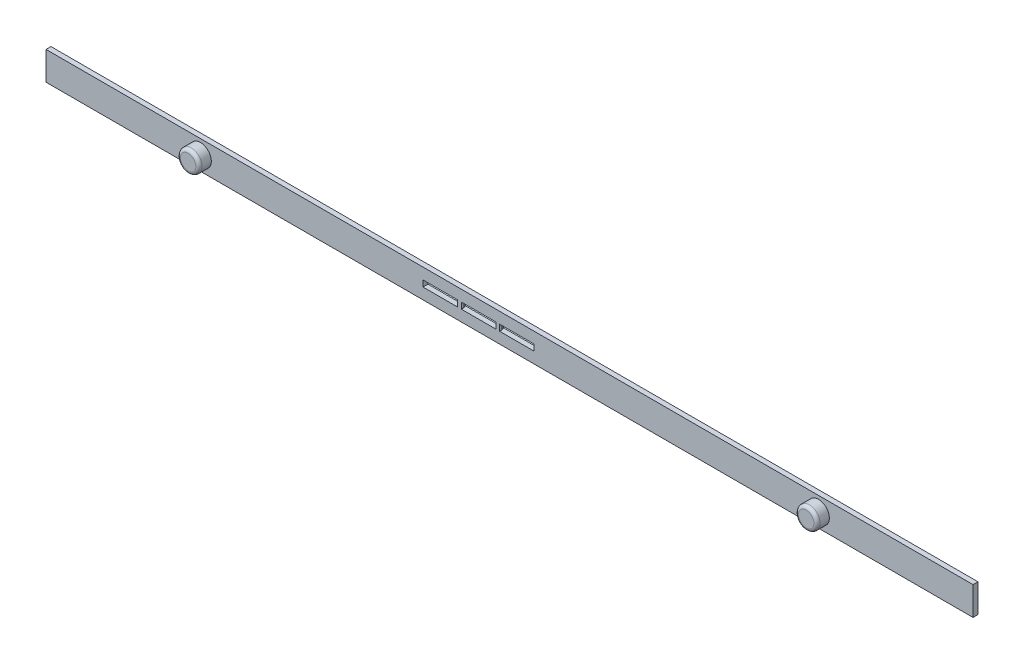
ISO-10303-21;
HEADER;
FILE_DESCRIPTION(('STEP AP214'),'2;1');
FILE_NAME('part.step','',(''),(''),'','','');
FILE_SCHEMA(('AUTOMOTIVE_DESIGN { 1 0 10303 214 1 1 1 1 }'));
ENDSEC;
DATA;
#1=APPLICATION_CONTEXT('core data for automotive mechanical design processes');
#2=APPLICATION_PROTOCOL_DEFINITION('international standard','automotive_design',2000,#1);
#3=PRODUCT_CONTEXT('',#1,'mechanical');
#4=PRODUCT('Part','Part','',(#3));
#5=PRODUCT_RELATED_PRODUCT_CATEGORY('part','',(#4));
#6=PRODUCT_DEFINITION_FORMATION('','',#4);
#7=PRODUCT_DEFINITION_CONTEXT('part definition',#1,'design');
#8=PRODUCT_DEFINITION('design','',#6,#7);
#9=PRODUCT_DEFINITION_SHAPE('','',#8);
#10=(LENGTH_UNIT() NAMED_UNIT(*) SI_UNIT(.MILLI.,.METRE.));
#11=(NAMED_UNIT(*) PLANE_ANGLE_UNIT() SI_UNIT($,.RADIAN.));
#12=(NAMED_UNIT(*) SI_UNIT($,.STERADIAN.) SOLID_ANGLE_UNIT());
#13=UNCERTAINTY_MEASURE_WITH_UNIT(LENGTH_MEASURE(1.E-05),#10,'distance_accuracy_value','');
#14=(GEOMETRIC_REPRESENTATION_CONTEXT(3) GLOBAL_UNCERTAINTY_ASSIGNED_CONTEXT((#13)) GLOBAL_UNIT_ASSIGNED_CONTEXT((#10,
#11,#12)) REPRESENTATION_CONTEXT('',''));
#15=CARTESIAN_POINT('',(0.,0.,0.));
#16=DIRECTION('',(0.,0.,1.));
#17=DIRECTION('',(1.,0.,0.));
#18=AXIS2_PLACEMENT_3D('',#15,#16,#17);
#19=CARTESIAN_POINT('',(4.,-0.499999999999995,0.8));
#20=DIRECTION('',(0.,1.,0.));
#21=DIRECTION('',(-1.,0.,0.));
#22=AXIS2_PLACEMENT_3D('',#19,#20,#21);
#23=PLANE('',#22);
#24=DIRECTION('',(0.,0.,-1.));
#25=VECTOR('',#24,1.);
#26=CARTESIAN_POINT('',(-8.4,-0.499999999999997,0.8));
#27=LINE('',#26,#25);
#28=CARTESIAN_POINT('',(-8.4,-0.499999999999997,0.8));
#29=VERTEX_POINT('',#28);
#30=CARTESIAN_POINT('',(-8.4,-0.499999999999997,0.400000000000012));
#31=VERTEX_POINT('',#30);
#32=EDGE_CURVE('E176',#29,#31,#27,.T.);
#33=ORIENTED_EDGE('',*,*,#32,.T.);
#34=DIRECTION('',(0.342020143325663,0.,-0.939692620785911));
#35=VECTOR('',#34,1.);
#36=CARTESIAN_POINT('',(-8.25441190629352,-0.499999999999996,0.));
#37=LINE('',#36,#35);
#38=CARTESIAN_POINT('',(-8.25441190629352,-0.499999999999996,0.));
#39=VERTEX_POINT('',#38);
#40=EDGE_CURVE('E289',#31,#39,#37,.T.);
#41=ORIENTED_EDGE('',*,*,#40,.T.);
#42=DIRECTION('',(1.,0.,0.));
#43=VECTOR('',#42,1.);
#44=CARTESIAN_POINT('',(4.,-0.499999999999995,0.));
#45=LINE('',#44,#43);
#46=CARTESIAN_POINT('',(-14.,-0.499999999999997,0.));
#47=VERTEX_POINT('',#46);
#48=EDGE_CURVE('E315',#47,#39,#45,.T.);
#49=ORIENTED_EDGE('',*,*,#48,.F.);
#50=DIRECTION('',(0.,0.,-1.));
#51=VECTOR('',#50,1.);
#52=CARTESIAN_POINT('',(-14.,-0.499999999999997,0.8));
#53=LINE('',#52,#51);
#54=CARTESIAN_POINT('',(-14.,-0.499999999999997,0.8));
#55=VERTEX_POINT('',#54);
#56=EDGE_CURVE('E219',#55,#47,#53,.T.);
#57=ORIENTED_EDGE('',*,*,#56,.F.);
#58=DIRECTION('',(1.,0.,0.));
#59=VECTOR('',#58,1.);
#60=CARTESIAN_POINT('',(4.,-0.499999999999995,0.8));
#61=LINE('',#60,#59);
#62=EDGE_CURVE('E202',#55,#29,#61,.T.);
#63=ORIENTED_EDGE('',*,*,#62,.T.);
#64=EDGE_LOOP('',(#33,#41,#49,#57,#63));
#65=FACE_BOUND('',#64,.T.);
#66=ADVANCED_FACE('F33',(#65),#23,.T.);
#67=CARTESIAN_POINT('',(4.,0.500000000000005,0.8));
#68=DIRECTION('',(0.,-1.,0.));
#69=DIRECTION('',(1.,0.,0.));
#70=AXIS2_PLACEMENT_3D('',#67,#68,#69);
#71=PLANE('',#70);
#72=DIRECTION('',(0.,0.,-1.));
#73=VECTOR('',#72,1.);
#74=CARTESIAN_POINT('',(-8.4,0.499999999999994,0.8));
#75=LINE('',#74,#73);
#76=CARTESIAN_POINT('',(-8.4,0.499999999999994,0.8));
#77=VERTEX_POINT('',#76);
#78=CARTESIAN_POINT('',(-8.4,0.499999999999994,0.400000000000012));
#79=VERTEX_POINT('',#78);
#80=EDGE_CURVE('E173',#77,#79,#75,.T.);
#81=ORIENTED_EDGE('',*,*,#80,.F.);
#82=DIRECTION('',(-1.,0.,0.));
#83=VECTOR('',#82,1.);
#84=CARTESIAN_POINT('',(4.,0.500000000000005,0.8));
#85=LINE('',#84,#83);
#86=CARTESIAN_POINT('',(-14.,0.500000000000003,0.8));
#87=VERTEX_POINT('',#86);
#88=EDGE_CURVE('E186',#77,#87,#85,.T.);
#89=ORIENTED_EDGE('',*,*,#88,.T.);
#90=DIRECTION('',(0.,0.,-1.));
#91=VECTOR('',#90,1.);
#92=CARTESIAN_POINT('',(-14.,0.500000000000003,0.8));
#93=LINE('',#92,#91);
#94=CARTESIAN_POINT('',(-14.,0.500000000000003,0.));
#95=VERTEX_POINT('',#94);
#96=EDGE_CURVE('E206',#87,#95,#93,.T.);
#97=ORIENTED_EDGE('',*,*,#96,.T.);
#98=DIRECTION('',(-1.,0.,0.));
#99=VECTOR('',#98,1.);
#100=CARTESIAN_POINT('',(4.,0.500000000000005,0.));
#101=LINE('',#100,#99);
#102=CARTESIAN_POINT('',(-8.25441190629352,0.500000000000004,0.));
#103=VERTEX_POINT('',#102);
#104=EDGE_CURVE('E321',#103,#95,#101,.T.);
#105=ORIENTED_EDGE('',*,*,#104,.F.);
#106=DIRECTION('',(-0.342020143325663,0.,0.939692620785911));
#107=VECTOR('',#106,1.);
#108=CARTESIAN_POINT('',(-8.25441190629352,0.500000000000004,0.));
#109=LINE('',#108,#107);
#110=EDGE_CURVE('E189',#103,#79,#109,.T.);
#111=ORIENTED_EDGE('',*,*,#110,.T.);
#112=EDGE_LOOP('',(#81,#89,#97,#105,#111));
#113=FACE_BOUND('',#112,.T.);
#114=ADVANCED_FACE('F184',(#113),#71,.T.);
#115=DIRECTION('',(0.,0.,-1.));
#116=VECTOR('',#115,1.);
#117=CARTESIAN_POINT('',(-1.6,-0.500000000000001,0.8));
#118=LINE('',#117,#116);
#119=CARTESIAN_POINT('',(-1.6,-0.500000000000001,0.8));
#120=VERTEX_POINT('',#119);
#121=CARTESIAN_POINT('',(-1.6,-0.500000000000001,0.400000000000011));
#122=VERTEX_POINT('',#121);
#123=EDGE_CURVE('E349',#120,#122,#118,.T.);
#124=ORIENTED_EDGE('',*,*,#123,.F.);
#125=CARTESIAN_POINT('',(4.,-0.499999999999995,0.8));
#126=VERTEX_POINT('',#125);
#127=EDGE_CURVE('E328',#120,#126,#61,.T.);
#128=ORIENTED_EDGE('',*,*,#127,.T.);
#129=DIRECTION('',(0.,0.,-1.));
#130=VECTOR('',#129,1.);
#131=CARTESIAN_POINT('',(4.,-0.499999999999995,0.8));
#132=LINE('',#131,#130);
#133=CARTESIAN_POINT('',(4.,-0.499999999999995,0.));
#134=VERTEX_POINT('',#133);
#135=EDGE_CURVE('E211',#126,#134,#132,.T.);
#136=ORIENTED_EDGE('',*,*,#135,.T.);
#137=CARTESIAN_POINT('',(-1.74558809370649,-0.499999999999995,0.));
#138=VERTEX_POINT('',#137);
#139=EDGE_CURVE('E316',#138,#134,#45,.T.);
#140=ORIENTED_EDGE('',*,*,#139,.F.);
#141=DIRECTION('',(0.342020143325676,0.,0.939692620785906));
#142=VECTOR('',#141,1.);
#143=CARTESIAN_POINT('',(-1.74558809370649,-0.499999999999995,0.));
#144=LINE('',#143,#142);
#145=EDGE_CURVE('E41',#138,#122,#144,.T.);
#146=ORIENTED_EDGE('',*,*,#145,.T.);
#147=EDGE_LOOP('',(#124,#128,#136,#140,#146));
#148=FACE_BOUND('',#147,.T.);
#149=ADVANCED_FACE('F384',(#148),#23,.T.);
#150=DIRECTION('',(0.,0.,-1.));
#151=VECTOR('',#150,1.);
#152=CARTESIAN_POINT('',(-1.6,0.499999999999997,0.8));
#153=LINE('',#152,#151);
#154=CARTESIAN_POINT('',(-1.6,0.499999999999997,0.8));
#155=VERTEX_POINT('',#154);
#156=CARTESIAN_POINT('',(-1.6,0.499999999999997,0.400000000000011));
#157=VERTEX_POINT('',#156);
#158=EDGE_CURVE('E358',#155,#157,#153,.T.);
#159=ORIENTED_EDGE('',*,*,#158,.T.);
#160=DIRECTION('',(-0.342020143325676,0.,-0.939692620785906));
#161=VECTOR('',#160,1.);
#162=CARTESIAN_POINT('',(-1.74558809370649,0.500000000000005,0.));
#163=LINE('',#162,#161);
#164=CARTESIAN_POINT('',(-1.74558809370649,0.500000000000005,0.));
#165=VERTEX_POINT('',#164);
#166=EDGE_CURVE('E11',#157,#165,#163,.T.);
#167=ORIENTED_EDGE('',*,*,#166,.T.);
#168=CARTESIAN_POINT('',(4.,0.500000000000005,0.));
#169=VERTEX_POINT('',#168);
#170=EDGE_CURVE('E214',#169,#165,#101,.T.);
#171=ORIENTED_EDGE('',*,*,#170,.F.);
#172=DIRECTION('',(0.,0.,-1.));
#173=VECTOR('',#172,1.);
#174=CARTESIAN_POINT('',(4.,0.500000000000005,0.8));
#175=LINE('',#174,#173);
#176=CARTESIAN_POINT('',(4.,0.500000000000005,0.8));
#177=VERTEX_POINT('',#176);
#178=EDGE_CURVE('E209',#177,#169,#175,.T.);
#179=ORIENTED_EDGE('',*,*,#178,.F.);
#180=EDGE_CURVE('E199',#177,#155,#85,.T.);
#181=ORIENTED_EDGE('',*,*,#180,.T.);
#182=EDGE_LOOP('',(#159,#167,#171,#179,#181));
#183=FACE_BOUND('',#182,.T.);
#184=ADVANCED_FACE('F390',(#183),#71,.T.);
#185=CARTESIAN_POINT('',(0.,0.,0.8));
#186=DIRECTION('',(0.,0.,1.));
#187=DIRECTION('',(1.,0.,0.));
#188=AXIS2_PLACEMENT_3D('',#185,#186,#187);
#189=PLANE('',#188);
#190=DIRECTION('',(0.,1.,0.));
#191=VECTOR('',#190,1.);
#192=CARTESIAN_POINT('',(-8.4,0.499999999999994,0.8));
#193=LINE('',#192,#191);
#194=EDGE_CURVE('E170',#29,#77,#193,.T.);
#195=ORIENTED_EDGE('',*,*,#194,.F.);
#196=ORIENTED_EDGE('',*,*,#62,.F.);
#197=DIRECTION('',(0.,-1.,0.));
#198=VECTOR('',#197,1.);
#199=CARTESIAN_POINT('',(-14.,0.500000000000003,0.8));
#200=LINE('',#199,#198);
#201=EDGE_CURVE('E195',#87,#55,#200,.T.);
#202=ORIENTED_EDGE('',*,*,#201,.F.);
#203=ORIENTED_EDGE('',*,*,#88,.F.);
#204=EDGE_LOOP('',(#195,#196,#202,#203));
#205=FACE_BOUND('',#204,.T.);
#206=DIRECTION('',(0.,1.,0.));
#207=VECTOR('',#206,1.);
#208=CARTESIAN_POINT('',(-2.2,0.499999999999994,0.8));
#209=LINE('',#208,#207);
#210=CARTESIAN_POINT('',(-2.2,-0.499999999999997,0.8));
#211=VERTEX_POINT('',#210);
#212=CARTESIAN_POINT('',(-2.2,0.499999999999994,0.8));
#213=VERTEX_POINT('',#212);
#214=EDGE_CURVE('E346',#211,#213,#209,.T.);
#215=ORIENTED_EDGE('',*,*,#214,.F.);
#216=CARTESIAN_POINT('',(-7.8,-0.499999999999997,0.8));
#217=VERTEX_POINT('',#216);
#218=EDGE_CURVE('E332',#217,#211,#61,.T.);
#219=ORIENTED_EDGE('',*,*,#218,.F.);
#220=DIRECTION('',(0.,-1.,0.));
#221=VECTOR('',#220,1.);
#222=CARTESIAN_POINT('',(-7.8,0.499999999999994,0.8));
#223=LINE('',#222,#221);
#224=CARTESIAN_POINT('',(-7.8,0.499999999999994,0.8));
#225=VERTEX_POINT('',#224);
#226=EDGE_CURVE('E181',#225,#217,#223,.T.);
#227=ORIENTED_EDGE('',*,*,#226,.F.);
#228=EDGE_CURVE('E196',#213,#225,#85,.T.);
#229=ORIENTED_EDGE('',*,*,#228,.F.);
#230=EDGE_LOOP('',(#215,#219,#227,#229));
#231=FACE_BOUND('',#230,.T.);
#232=CARTESIAN_POINT('',(50.,0.,0.8));
#233=DIRECTION('',(0.,0.,1.));
#234=DIRECTION('',(1.,0.,0.));
#235=AXIS2_PLACEMENT_3D('',#232,#233,#234);
#236=CIRCLE('',#235,1.75);
#237=CARTESIAN_POINT('',(51.75,0.,0.8));
#238=VERTEX_POINT('',#237);
#239=EDGE_CURVE('E360',#238,#238,#236,.T.);
#240=ORIENTED_EDGE('',*,*,#239,.F.);
#241=EDGE_LOOP('',(#240));
#242=FACE_BOUND('',#241,.T.);
#243=CARTESIAN_POINT('',(-50.,0.,0.8));
#244=DIRECTION('',(0.,0.,1.));
#245=DIRECTION('',(1.,0.,0.));
#246=AXIS2_PLACEMENT_3D('',#243,#244,#245);
#247=CIRCLE('',#246,1.75);
#248=CARTESIAN_POINT('',(-48.25,0.,0.8));
#249=VERTEX_POINT('',#248);
#250=EDGE_CURVE('E335',#249,#249,#247,.T.);
#251=ORIENTED_EDGE('',*,*,#250,.F.);
#252=EDGE_LOOP('',(#251));
#253=FACE_BOUND('',#252,.T.);
#254=DIRECTION('',(0.,1.,0.));
#255=VECTOR('',#254,1.);
#256=CARTESIAN_POINT('',(75.,2.3,0.8));
#257=LINE('',#256,#255);
#258=CARTESIAN_POINT('',(75.,-2.3,0.8));
#259=VERTEX_POINT('',#258);
#260=CARTESIAN_POINT('',(75.,2.3,0.8));
#261=VERTEX_POINT('',#260);
#262=EDGE_CURVE('E223',#259,#261,#257,.T.);
#263=ORIENTED_EDGE('',*,*,#262,.T.);
#264=DIRECTION('',(-1.,0.,0.));
#265=VECTOR('',#264,1.);
#266=CARTESIAN_POINT('',(-75.,2.3,0.8));
#267=LINE('',#266,#265);
#268=CARTESIAN_POINT('',(-75.,2.3,0.8));
#269=VERTEX_POINT('',#268);
#270=EDGE_CURVE('E226',#261,#269,#267,.T.);
#271=ORIENTED_EDGE('',*,*,#270,.T.);
#272=DIRECTION('',(0.,-1.,0.));
#273=VECTOR('',#272,1.);
#274=CARTESIAN_POINT('',(-75.,2.3,0.8));
#275=LINE('',#274,#273);
#276=CARTESIAN_POINT('',(-75.,-2.30000000000001,0.8));
#277=VERTEX_POINT('',#276);
#278=EDGE_CURVE('E229',#269,#277,#275,.T.);
#279=ORIENTED_EDGE('',*,*,#278,.T.);
#280=DIRECTION('',(1.,0.,0.));
#281=VECTOR('',#280,1.);
#282=CARTESIAN_POINT('',(-75.,-2.30000000000001,0.8));
#283=LINE('',#282,#281);
#284=EDGE_CURVE('E231',#277,#259,#283,.T.);
#285=ORIENTED_EDGE('',*,*,#284,.T.);
#286=EDGE_LOOP('',(#263,#271,#279,#285));
#287=FACE_BOUND('',#286,.T.);
#288=ORIENTED_EDGE('',*,*,#127,.F.);
#289=DIRECTION('',(0.,-1.,0.));
#290=VECTOR('',#289,1.);
#291=CARTESIAN_POINT('',(-1.6,0.499999999999997,0.8));
#292=LINE('',#291,#290);
#293=EDGE_CURVE('E353',#155,#120,#292,.T.);
#294=ORIENTED_EDGE('',*,*,#293,.F.);
#295=ORIENTED_EDGE('',*,*,#180,.F.);
#296=DIRECTION('',(0.,1.,0.));
#297=VECTOR('',#296,1.);
#298=CARTESIAN_POINT('',(4.,0.500000000000005,0.8));
#299=LINE('',#298,#297);
#300=EDGE_CURVE('E197',#126,#177,#299,.T.);
#301=ORIENTED_EDGE('',*,*,#300,.F.);
#302=EDGE_LOOP('',(#288,#294,#295,#301));
#303=FACE_BOUND('',#302,.T.);
#304=ADVANCED_FACE('F193',(#205,#231,#242,#253,#287,#303),#189,.T.);
#305=CARTESIAN_POINT('',(0.,0.,0.));
#306=DIRECTION('',(0.,0.,1.));
#307=DIRECTION('',(1.,0.,0.));
#308=AXIS2_PLACEMENT_3D('',#305,#306,#307);
#309=PLANE('',#308);
#310=DIRECTION('',(0.,1.,0.));
#311=VECTOR('',#310,1.);
#312=CARTESIAN_POINT('',(-8.25441190629352,0.500000000000004,0.));
#313=LINE('',#312,#311);
#314=EDGE_CURVE('E270',#39,#103,#313,.T.);
#315=ORIENTED_EDGE('',*,*,#314,.T.);
#316=ORIENTED_EDGE('',*,*,#104,.T.);
#317=DIRECTION('',(0.,-1.,0.));
#318=VECTOR('',#317,1.);
#319=CARTESIAN_POINT('',(-14.,0.500000000000003,0.));
#320=LINE('',#319,#318);
#321=EDGE_CURVE('E319',#95,#47,#320,.T.);
#322=ORIENTED_EDGE('',*,*,#321,.T.);
#323=ORIENTED_EDGE('',*,*,#48,.T.);
#324=EDGE_LOOP('',(#315,#316,#322,#323));
#325=FACE_BOUND('',#324,.T.);
#326=DIRECTION('',(0.,-1.,0.));
#327=VECTOR('',#326,1.);
#328=CARTESIAN_POINT('',(-7.94558809370648,-0.499999999999996,0.));
#329=LINE('',#328,#327);
#330=CARTESIAN_POINT('',(-7.94558809370648,0.500000000000004,0.));
#331=VERTEX_POINT('',#330);
#332=CARTESIAN_POINT('',(-7.94558809370648,-0.499999999999996,0.));
#333=VERTEX_POINT('',#332);
#334=EDGE_CURVE('E273',#331,#333,#329,.T.);
#335=ORIENTED_EDGE('',*,*,#334,.T.);
#336=CARTESIAN_POINT('',(-2.0544119062935,-0.499999999999995,0.));
#337=VERTEX_POINT('',#336);
#338=EDGE_CURVE('E302',#333,#337,#45,.T.);
#339=ORIENTED_EDGE('',*,*,#338,.T.);
#340=DIRECTION('',(0.,1.,0.));
#341=VECTOR('',#340,1.);
#342=CARTESIAN_POINT('',(-2.0544119062935,0.500000000000004,0.));
#343=LINE('',#342,#341);
#344=CARTESIAN_POINT('',(-2.0544119062935,0.500000000000005,0.));
#345=VERTEX_POINT('',#344);
#346=EDGE_CURVE('E267',#337,#345,#343,.T.);
#347=ORIENTED_EDGE('',*,*,#346,.T.);
#348=EDGE_CURVE('E313',#345,#331,#101,.T.);
#349=ORIENTED_EDGE('',*,*,#348,.T.);
#350=EDGE_LOOP('',(#335,#339,#347,#349));
#351=FACE_BOUND('',#350,.T.);
#352=DIRECTION('',(0.,1.,0.));
#353=VECTOR('',#352,1.);
#354=CARTESIAN_POINT('',(75.,2.3,0.));
#355=LINE('',#354,#353);
#356=CARTESIAN_POINT('',(75.,-2.3,0.));
#357=VERTEX_POINT('',#356);
#358=CARTESIAN_POINT('',(75.,2.3,0.));
#359=VERTEX_POINT('',#358);
#360=EDGE_CURVE('E222',#357,#359,#355,.T.);
#361=ORIENTED_EDGE('',*,*,#360,.F.);
#362=DIRECTION('',(1.,0.,0.));
#363=VECTOR('',#362,1.);
#364=CARTESIAN_POINT('',(-75.,-2.30000000000001,0.));
#365=LINE('',#364,#363);
#366=CARTESIAN_POINT('',(-75.,-2.30000000000001,0.));
#367=VERTEX_POINT('',#366);
#368=EDGE_CURVE('E227',#367,#357,#365,.T.);
#369=ORIENTED_EDGE('',*,*,#368,.F.);
#370=DIRECTION('',(0.,-1.,0.));
#371=VECTOR('',#370,1.);
#372=CARTESIAN_POINT('',(-75.,2.3,0.));
#373=LINE('',#372,#371);
#374=CARTESIAN_POINT('',(-75.,2.3,0.));
#375=VERTEX_POINT('',#374);
#376=EDGE_CURVE('E238',#375,#367,#373,.T.);
#377=ORIENTED_EDGE('',*,*,#376,.F.);
#378=DIRECTION('',(-1.,0.,0.));
#379=VECTOR('',#378,1.);
#380=CARTESIAN_POINT('',(-75.,2.3,0.));
#381=LINE('',#380,#379);
#382=EDGE_CURVE('E236',#359,#375,#381,.T.);
#383=ORIENTED_EDGE('',*,*,#382,.F.);
#384=EDGE_LOOP('',(#361,#369,#377,#383));
#385=FACE_BOUND('',#384,.T.);
#386=DIRECTION('',(0.,-1.,0.));
#387=VECTOR('',#386,1.);
#388=CARTESIAN_POINT('',(-1.74558809370649,-0.499999999999995,0.));
#389=LINE('',#388,#387);
#390=EDGE_CURVE('E264',#165,#138,#389,.T.);
#391=ORIENTED_EDGE('',*,*,#390,.T.);
#392=ORIENTED_EDGE('',*,*,#139,.T.);
#393=DIRECTION('',(0.,1.,0.));
#394=VECTOR('',#393,1.);
#395=CARTESIAN_POINT('',(4.,0.500000000000005,0.));
#396=LINE('',#395,#394);
#397=EDGE_CURVE('E318',#134,#169,#396,.T.);
#398=ORIENTED_EDGE('',*,*,#397,.T.);
#399=ORIENTED_EDGE('',*,*,#170,.T.);
#400=EDGE_LOOP('',(#391,#392,#398,#399));
#401=FACE_BOUND('',#400,.T.);
#402=ADVANCED_FACE('F311',(#325,#351,#385,#401),#309,.F.);
#403=CARTESIAN_POINT('',(75.,2.3,0.8));
#404=DIRECTION('',(-1.,0.,0.));
#405=DIRECTION('',(0.,-1.,0.));
#406=AXIS2_PLACEMENT_3D('',#403,#404,#405);
#407=PLANE('',#406);
#408=ORIENTED_EDGE('',*,*,#360,.T.);
#409=DIRECTION('',(0.,0.,-1.));
#410=VECTOR('',#409,1.);
#411=CARTESIAN_POINT('',(75.,2.3,0.8));
#412=LINE('',#411,#410);
#413=EDGE_CURVE('E249',#261,#359,#412,.T.);
#414=ORIENTED_EDGE('',*,*,#413,.F.);
#415=ORIENTED_EDGE('',*,*,#262,.F.);
#416=DIRECTION('',(0.,0.,-1.));
#417=VECTOR('',#416,1.);
#418=CARTESIAN_POINT('',(75.,-2.3,0.8));
#419=LINE('',#418,#417);
#420=EDGE_CURVE('E233',#259,#357,#419,.T.);
#421=ORIENTED_EDGE('',*,*,#420,.T.);
#422=EDGE_LOOP('',(#408,#414,#415,#421));
#423=FACE_BOUND('',#422,.T.);
#424=ADVANCED_FACE('F415',(#423),#407,.F.);
#425=CARTESIAN_POINT('',(-75.,2.3,0.8));
#426=DIRECTION('',(0.,-1.,0.));
#427=DIRECTION('',(0.,0.,-1.));
#428=AXIS2_PLACEMENT_3D('',#425,#426,#427);
#429=PLANE('',#428);
#430=ORIENTED_EDGE('',*,*,#382,.T.);
#431=DIRECTION('',(0.,0.,-1.));
#432=VECTOR('',#431,1.);
#433=CARTESIAN_POINT('',(-75.,2.3,0.8));
#434=LINE('',#433,#432);
#435=EDGE_CURVE('E246',#269,#375,#434,.T.);
#436=ORIENTED_EDGE('',*,*,#435,.F.);
#437=ORIENTED_EDGE('',*,*,#270,.F.);
#438=ORIENTED_EDGE('',*,*,#413,.T.);
#439=EDGE_LOOP('',(#430,#436,#437,#438));
#440=FACE_BOUND('',#439,.T.);
#441=ADVANCED_FACE('F419',(#440),#429,.F.);
#442=CARTESIAN_POINT('',(-75.,2.3,0.8));
#443=DIRECTION('',(1.,0.,0.));
#444=DIRECTION('',(0.,1.,0.));
#445=AXIS2_PLACEMENT_3D('',#442,#443,#444);
#446=PLANE('',#445);
#447=ORIENTED_EDGE('',*,*,#376,.T.);
#448=DIRECTION('',(0.,0.,-1.));
#449=VECTOR('',#448,1.);
#450=CARTESIAN_POINT('',(-75.,-2.30000000000001,0.8));
#451=LINE('',#450,#449);
#452=EDGE_CURVE('E243',#277,#367,#451,.T.);
#453=ORIENTED_EDGE('',*,*,#452,.F.);
#454=ORIENTED_EDGE('',*,*,#278,.F.);
#455=ORIENTED_EDGE('',*,*,#435,.T.);
#456=EDGE_LOOP('',(#447,#453,#454,#455));
#457=FACE_BOUND('',#456,.T.);
#458=ADVANCED_FACE('F408',(#457),#446,.F.);
#459=CARTESIAN_POINT('',(-75.,-2.30000000000001,0.8));
#460=DIRECTION('',(0.,1.,0.));
#461=DIRECTION('',(-1.,0.,0.));
#462=AXIS2_PLACEMENT_3D('',#459,#460,#461);
#463=PLANE('',#462);
#464=ORIENTED_EDGE('',*,*,#368,.T.);
#465=ORIENTED_EDGE('',*,*,#420,.F.);
#466=ORIENTED_EDGE('',*,*,#284,.F.);
#467=ORIENTED_EDGE('',*,*,#452,.T.);
#468=EDGE_LOOP('',(#464,#465,#466,#467));
#469=FACE_BOUND('',#468,.T.);
#470=ADVANCED_FACE('F404',(#469),#463,.F.);
#471=CARTESIAN_POINT('',(-14.,0.500000000000003,0.8));
#472=DIRECTION('',(1.,0.,0.));
#473=DIRECTION('',(0.,0.,-1.));
#474=AXIS2_PLACEMENT_3D('',#471,#472,#473);
#475=PLANE('',#474);
#476=ORIENTED_EDGE('',*,*,#321,.F.);
#477=ORIENTED_EDGE('',*,*,#96,.F.);
#478=ORIENTED_EDGE('',*,*,#201,.T.);
#479=ORIENTED_EDGE('',*,*,#56,.T.);
#480=EDGE_LOOP('',(#476,#477,#478,#479));
#481=FACE_BOUND('',#480,.T.);
#482=ADVANCED_FACE('F367',(#481),#475,.T.);
#483=DIRECTION('',(0.,0.,-1.));
#484=VECTOR('',#483,1.);
#485=CARTESIAN_POINT('',(-7.8,-0.499999999999997,0.8));
#486=LINE('',#485,#484);
#487=CARTESIAN_POINT('',(-7.8,-0.499999999999997,0.400000000000012));
#488=VERTEX_POINT('',#487);
#489=EDGE_CURVE('E340',#217,#488,#486,.T.);
#490=ORIENTED_EDGE('',*,*,#489,.F.);
#491=ORIENTED_EDGE('',*,*,#218,.T.);
#492=DIRECTION('',(0.,0.,-1.));
#493=VECTOR('',#492,1.);
#494=CARTESIAN_POINT('',(-2.2,-0.499999999999997,0.8));
#495=LINE('',#494,#493);
#496=CARTESIAN_POINT('',(-2.2,-0.499999999999997,0.400000000000039));
#497=VERTEX_POINT('',#496);
#498=EDGE_CURVE('E305',#211,#497,#495,.T.);
#499=ORIENTED_EDGE('',*,*,#498,.T.);
#500=DIRECTION('',(0.342020143325671,0.,-0.939692620785908));
#501=VECTOR('',#500,1.);
#502=CARTESIAN_POINT('',(-2.0544119062935,-0.499999999999995,0.));
#503=LINE('',#502,#501);
#504=EDGE_CURVE('E294',#497,#337,#503,.T.);
#505=ORIENTED_EDGE('',*,*,#504,.T.);
#506=ORIENTED_EDGE('',*,*,#338,.F.);
#507=DIRECTION('',(0.342020143325663,0.,0.939692620785911));
#508=VECTOR('',#507,1.);
#509=CARTESIAN_POINT('',(-7.94558809370648,-0.499999999999996,0.));
#510=LINE('',#509,#508);
#511=EDGE_CURVE('E283',#333,#488,#510,.T.);
#512=ORIENTED_EDGE('',*,*,#511,.T.);
#513=EDGE_LOOP('',(#490,#491,#499,#505,#506,#512));
#514=FACE_BOUND('',#513,.T.);
#515=ADVANCED_FACE('F301',(#514),#23,.T.);
#516=CARTESIAN_POINT('',(4.,0.500000000000005,0.8));
#517=DIRECTION('',(-1.,0.,0.));
#518=DIRECTION('',(0.,0.,1.));
#519=AXIS2_PLACEMENT_3D('',#516,#517,#518);
#520=PLANE('',#519);
#521=ORIENTED_EDGE('',*,*,#397,.F.);
#522=ORIENTED_EDGE('',*,*,#135,.F.);
#523=ORIENTED_EDGE('',*,*,#300,.T.);
#524=ORIENTED_EDGE('',*,*,#178,.T.);
#525=EDGE_LOOP('',(#521,#522,#523,#524));
#526=FACE_BOUND('',#525,.T.);
#527=ADVANCED_FACE('F396',(#526),#520,.T.);
#528=DIRECTION('',(0.,0.,-1.));
#529=VECTOR('',#528,1.);
#530=CARTESIAN_POINT('',(-7.8,0.499999999999994,0.8));
#531=LINE('',#530,#529);
#532=CARTESIAN_POINT('',(-7.8,0.499999999999994,0.400000000000012));
#533=VERTEX_POINT('',#532);
#534=EDGE_CURVE('E190',#225,#533,#531,.T.);
#535=ORIENTED_EDGE('',*,*,#534,.T.);
#536=DIRECTION('',(-0.342020143325663,0.,-0.939692620785911));
#537=VECTOR('',#536,1.);
#538=CARTESIAN_POINT('',(-7.94558809370648,0.500000000000004,0.));
#539=LINE('',#538,#537);
#540=EDGE_CURVE('E285',#533,#331,#539,.T.);
#541=ORIENTED_EDGE('',*,*,#540,.T.);
#542=ORIENTED_EDGE('',*,*,#348,.F.);
#543=DIRECTION('',(-0.342020143325671,0.,0.939692620785908));
#544=VECTOR('',#543,1.);
#545=CARTESIAN_POINT('',(-2.0544119062935,0.500000000000005,0.));
#546=LINE('',#545,#544);
#547=CARTESIAN_POINT('',(-2.2,0.499999999999994,0.400000000000039));
#548=VERTEX_POINT('',#547);
#549=EDGE_CURVE('E292',#345,#548,#546,.T.);
#550=ORIENTED_EDGE('',*,*,#549,.T.);
#551=DIRECTION('',(0.,0.,-1.));
#552=VECTOR('',#551,1.);
#553=CARTESIAN_POINT('',(-2.2,0.499999999999994,0.8));
#554=LINE('',#553,#552);
#555=EDGE_CURVE('E348',#213,#548,#554,.T.);
#556=ORIENTED_EDGE('',*,*,#555,.F.);
#557=ORIENTED_EDGE('',*,*,#228,.T.);
#558=EDGE_LOOP('',(#535,#541,#542,#550,#556,#557));
#559=FACE_BOUND('',#558,.T.);
#560=ADVANCED_FACE('F391',(#559),#71,.T.);
#561=CARTESIAN_POINT('',(-50.,0.,2.8));
#562=DIRECTION('',(0.,0.,-1.));
#563=DIRECTION('',(-1.,0.,0.));
#564=AXIS2_PLACEMENT_3D('',#561,#562,#563);
#565=CYLINDRICAL_SURFACE('',#564,1.75);
#566=CARTESIAN_POINT('',(-50.,0.,2.3));
#567=DIRECTION('',(0.,0.,1.));
#568=DIRECTION('',(1.,0.,0.));
#569=AXIS2_PLACEMENT_3D('',#566,#567,#568);
#570=CIRCLE('',#569,1.75);
#571=CARTESIAN_POINT('',(-48.25,0.,2.3));
#572=VERTEX_POINT('',#571);
#573=EDGE_CURVE('E261',#572,#572,#570,.F.);
#574=ORIENTED_EDGE('',*,*,#573,.T.);
#575=EDGE_LOOP('',(#574));
#576=FACE_BOUND('',#575,.T.);
#577=ORIENTED_EDGE('',*,*,#250,.T.);
#578=EDGE_LOOP('',(#577));
#579=FACE_BOUND('',#578,.T.);
#580=ADVANCED_FACE('F448',(#576,#579),#565,.T.);
#581=CARTESIAN_POINT('',(-50.,0.,2.8));
#582=DIRECTION('',(0.,0.,1.));
#583=DIRECTION('',(1.,0.,0.));
#584=AXIS2_PLACEMENT_3D('',#581,#582,#583);
#585=PLANE('',#584);
#586=CARTESIAN_POINT('',(-50.,0.,2.8));
#587=DIRECTION('',(0.,0.,1.));
#588=DIRECTION('',(1.,0.,0.));
#589=AXIS2_PLACEMENT_3D('',#586,#587,#588);
#590=CIRCLE('',#589,1.25);
#591=CARTESIAN_POINT('',(-48.75,0.,2.8));
#592=VERTEX_POINT('',#591);
#593=EDGE_CURVE('E258',#592,#592,#590,.T.);
#594=ORIENTED_EDGE('',*,*,#593,.T.);
#595=EDGE_LOOP('',(#594));
#596=FACE_BOUND('',#595,.T.);
#597=ADVANCED_FACE('F445',(#596),#585,.T.);
#598=CARTESIAN_POINT('',(50.,0.,2.8));
#599=DIRECTION('',(0.,0.,-1.));
#600=DIRECTION('',(-1.,0.,0.));
#601=AXIS2_PLACEMENT_3D('',#598,#599,#600);
#602=CYLINDRICAL_SURFACE('',#601,1.75);
#603=CARTESIAN_POINT('',(50.,0.,2.3));
#604=DIRECTION('',(0.,0.,1.));
#605=DIRECTION('',(1.,0.,0.));
#606=AXIS2_PLACEMENT_3D('',#603,#604,#605);
#607=CIRCLE('',#606,1.75);
#608=CARTESIAN_POINT('',(51.75,0.,2.3));
#609=VERTEX_POINT('',#608);
#610=EDGE_CURVE('E255',#609,#609,#607,.F.);
#611=ORIENTED_EDGE('',*,*,#610,.T.);
#612=EDGE_LOOP('',(#611));
#613=FACE_BOUND('',#612,.T.);
#614=ORIENTED_EDGE('',*,*,#239,.T.);
#615=EDGE_LOOP('',(#614));
#616=FACE_BOUND('',#615,.T.);
#617=ADVANCED_FACE('F447',(#613,#616),#602,.T.);
#618=CARTESIAN_POINT('',(50.,0.,2.8));
#619=DIRECTION('',(0.,0.,1.));
#620=DIRECTION('',(1.,0.,0.));
#621=AXIS2_PLACEMENT_3D('',#618,#619,#620);
#622=PLANE('',#621);
#623=CARTESIAN_POINT('',(50.,0.,2.8));
#624=DIRECTION('',(0.,0.,1.));
#625=DIRECTION('',(1.,0.,0.));
#626=AXIS2_PLACEMENT_3D('',#623,#624,#625);
#627=CIRCLE('',#626,1.25);
#628=CARTESIAN_POINT('',(51.25,0.,2.8));
#629=VERTEX_POINT('',#628);
#630=EDGE_CURVE('E252',#629,#629,#627,.T.);
#631=ORIENTED_EDGE('',*,*,#630,.T.);
#632=EDGE_LOOP('',(#631));
#633=FACE_BOUND('',#632,.T.);
#634=ADVANCED_FACE('F431',(#633),#622,.T.);
#635=CARTESIAN_POINT('',(50.,0.,2.3));
#636=DIRECTION('',(0.,0.,1.));
#637=DIRECTION('',(1.,0.,0.));
#638=AXIS2_PLACEMENT_3D('',#635,#636,#637);
#639=TOROIDAL_SURFACE('',#638,1.25,0.5);
#640=ORIENTED_EDGE('',*,*,#610,.F.);
#641=EDGE_LOOP('',(#640));
#642=FACE_BOUND('',#641,.T.);
#643=ORIENTED_EDGE('',*,*,#630,.F.);
#644=EDGE_LOOP('',(#643));
#645=FACE_BOUND('',#644,.T.);
#646=ADVANCED_FACE('F427',(#642,#645),#639,.T.);
#647=CARTESIAN_POINT('',(-50.,0.,2.3));
#648=DIRECTION('',(0.,0.,1.));
#649=DIRECTION('',(1.,0.,0.));
#650=AXIS2_PLACEMENT_3D('',#647,#648,#649);
#651=TOROIDAL_SURFACE('',#650,1.25,0.5);
#652=ORIENTED_EDGE('',*,*,#573,.F.);
#653=EDGE_LOOP('',(#652));
#654=FACE_BOUND('',#653,.T.);
#655=ORIENTED_EDGE('',*,*,#593,.F.);
#656=EDGE_LOOP('',(#655));
#657=FACE_BOUND('',#656,.T.);
#658=ADVANCED_FACE('F430',(#654,#657),#651,.T.);
#659=CARTESIAN_POINT('',(-1.6,0.499999999999997,0.8));
#660=DIRECTION('',(1.,0.,0.));
#661=DIRECTION('',(0.,1.,0.));
#662=AXIS2_PLACEMENT_3D('',#659,#660,#661);
#663=PLANE('',#662);
#664=ORIENTED_EDGE('',*,*,#123,.T.);
#665=DIRECTION('',(0.,1.,0.));
#666=VECTOR('',#665,1.);
#667=CARTESIAN_POINT('',(-1.6,0.499999999999997,0.400000000000011));
#668=LINE('',#667,#666);
#669=EDGE_CURVE('E54',#122,#157,#668,.T.);
#670=ORIENTED_EDGE('',*,*,#669,.T.);
#671=ORIENTED_EDGE('',*,*,#158,.F.);
#672=ORIENTED_EDGE('',*,*,#293,.T.);
#673=EDGE_LOOP('',(#664,#670,#671,#672));
#674=FACE_BOUND('',#673,.T.);
#675=ADVANCED_FACE('F434',(#674),#663,.T.);
#676=CARTESIAN_POINT('',(-2.2,0.499999999999994,0.8));
#677=DIRECTION('',(-1.,0.,0.));
#678=DIRECTION('',(0.,-1.,0.));
#679=AXIS2_PLACEMENT_3D('',#676,#677,#678);
#680=PLANE('',#679);
#681=ORIENTED_EDGE('',*,*,#555,.T.);
#682=DIRECTION('',(0.,-1.,0.));
#683=VECTOR('',#682,1.);
#684=CARTESIAN_POINT('',(-2.2,-0.499999999999997,0.400000000000039));
#685=LINE('',#684,#683);
#686=EDGE_CURVE('E280',#548,#497,#685,.T.);
#687=ORIENTED_EDGE('',*,*,#686,.T.);
#688=ORIENTED_EDGE('',*,*,#498,.F.);
#689=ORIENTED_EDGE('',*,*,#214,.T.);
#690=EDGE_LOOP('',(#681,#687,#688,#689));
#691=FACE_BOUND('',#690,.T.);
#692=ADVANCED_FACE('F345',(#691),#680,.T.);
#693=CARTESIAN_POINT('',(-8.4,0.499999999999994,0.8));
#694=DIRECTION('',(-1.,0.,0.));
#695=DIRECTION('',(0.,0.,1.));
#696=AXIS2_PLACEMENT_3D('',#693,#694,#695);
#697=PLANE('',#696);
#698=ORIENTED_EDGE('',*,*,#80,.T.);
#699=DIRECTION('',(0.,-1.,0.));
#700=VECTOR('',#699,1.);
#701=CARTESIAN_POINT('',(-8.4,-0.499999999999997,0.400000000000012));
#702=LINE('',#701,#700);
#703=EDGE_CURVE('E278',#79,#31,#702,.T.);
#704=ORIENTED_EDGE('',*,*,#703,.T.);
#705=ORIENTED_EDGE('',*,*,#32,.F.);
#706=ORIENTED_EDGE('',*,*,#194,.T.);
#707=EDGE_LOOP('',(#698,#704,#705,#706));
#708=FACE_BOUND('',#707,.T.);
#709=ADVANCED_FACE('F172',(#708),#697,.T.);
#710=CARTESIAN_POINT('',(-7.8,0.499999999999994,0.8));
#711=DIRECTION('',(1.,0.,0.));
#712=DIRECTION('',(0.,0.,-1.));
#713=AXIS2_PLACEMENT_3D('',#710,#711,#712);
#714=PLANE('',#713);
#715=ORIENTED_EDGE('',*,*,#489,.T.);
#716=DIRECTION('',(0.,1.,0.));
#717=VECTOR('',#716,1.);
#718=CARTESIAN_POINT('',(-7.8,0.499999999999994,0.400000000000012));
#719=LINE('',#718,#717);
#720=EDGE_CURVE('E276',#488,#533,#719,.T.);
#721=ORIENTED_EDGE('',*,*,#720,.T.);
#722=ORIENTED_EDGE('',*,*,#534,.F.);
#723=ORIENTED_EDGE('',*,*,#226,.T.);
#724=EDGE_LOOP('',(#715,#721,#722,#723));
#725=FACE_BOUND('',#724,.T.);
#726=ADVANCED_FACE('F379',(#725),#714,.T.);
#727=CARTESIAN_POINT('',(-7.94558809370648,0.,0.));
#728=DIRECTION('',(0.939692620785911,0.,-0.342020143325663));
#729=DIRECTION('',(0.,1.,0.));
#730=AXIS2_PLACEMENT_3D('',#727,#728,#729);
#731=PLANE('',#730);
#732=ORIENTED_EDGE('',*,*,#540,.F.);
#733=ORIENTED_EDGE('',*,*,#720,.F.);
#734=ORIENTED_EDGE('',*,*,#511,.F.);
#735=ORIENTED_EDGE('',*,*,#334,.F.);
#736=EDGE_LOOP('',(#732,#733,#734,#735));
#737=FACE_BOUND('',#736,.T.);
#738=ADVANCED_FACE('F373',(#737),#731,.T.);
#739=CARTESIAN_POINT('',(-8.25441190629352,0.,0.));
#740=DIRECTION('',(-0.939692620785911,0.,-0.342020143325663));
#741=DIRECTION('',(0.,-1.,0.));
#742=AXIS2_PLACEMENT_3D('',#739,#740,#741);
#743=PLANE('',#742);
#744=ORIENTED_EDGE('',*,*,#40,.F.);
#745=ORIENTED_EDGE('',*,*,#703,.F.);
#746=ORIENTED_EDGE('',*,*,#110,.F.);
#747=ORIENTED_EDGE('',*,*,#314,.F.);
#748=EDGE_LOOP('',(#744,#745,#746,#747));
#749=FACE_BOUND('',#748,.T.);
#750=ADVANCED_FACE('F371',(#749),#743,.T.);
#751=CARTESIAN_POINT('',(-2.0544119062935,0.,0.));
#752=DIRECTION('',(-0.939692620785908,0.,-0.342020143325671));
#753=DIRECTION('',(0.,-1.,0.));
#754=AXIS2_PLACEMENT_3D('',#751,#752,#753);
#755=PLANE('',#754);
#756=ORIENTED_EDGE('',*,*,#504,.F.);
#757=ORIENTED_EDGE('',*,*,#686,.F.);
#758=ORIENTED_EDGE('',*,*,#549,.F.);
#759=ORIENTED_EDGE('',*,*,#346,.F.);
#760=EDGE_LOOP('',(#756,#757,#758,#759));
#761=FACE_BOUND('',#760,.T.);
#762=ADVANCED_FACE('F309',(#761),#755,.T.);
#763=CARTESIAN_POINT('',(-1.74558809370649,0.,0.));
#764=DIRECTION('',(0.939692620785906,0.,-0.342020143325676));
#765=DIRECTION('',(0.,1.,0.));
#766=AXIS2_PLACEMENT_3D('',#763,#764,#765);
#767=PLANE('',#766);
#768=ORIENTED_EDGE('',*,*,#166,.F.);
#769=ORIENTED_EDGE('',*,*,#669,.F.);
#770=ORIENTED_EDGE('',*,*,#145,.F.);
#771=ORIENTED_EDGE('',*,*,#390,.F.);
#772=EDGE_LOOP('',(#768,#769,#770,#771));
#773=FACE_BOUND('',#772,.T.);
#774=ADVANCED_FACE('F35',(#773),#767,.T.);
#775=CLOSED_SHELL('',(#66,#114,#149,#184,#304,#402,#424,#441,#458,#470,#482,#515,#527,#560,#580,
#597,#617,#634,#646,#658,#675,#692,#709,#726,#738,#750,#762,#774));
#776=MANIFOLD_SOLID_BREP('B2',#775);
#777=ADVANCED_BREP_SHAPE_REPRESENTATION('',(#18,#776),#14);
#778=SHAPE_DEFINITION_REPRESENTATION(#9,#777);
ENDSEC;
END-ISO-10303-21;
